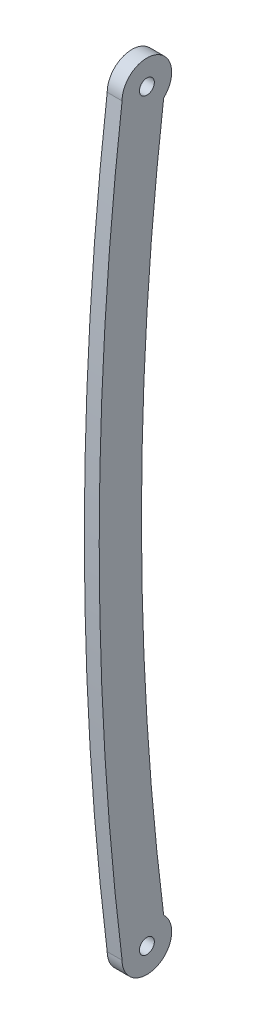
ISO-10303-21;
HEADER;
FILE_DESCRIPTION(('STEP AP214'),'2;1');
FILE_NAME('part.step','',(''),(''),'','','');
FILE_SCHEMA(('AUTOMOTIVE_DESIGN { 1 0 10303 214 1 1 1 1 }'));
ENDSEC;
DATA;
#1=APPLICATION_CONTEXT('core data for automotive mechanical design processes');
#2=APPLICATION_PROTOCOL_DEFINITION('international standard','automotive_design',2000,#1);
#3=PRODUCT_CONTEXT('',#1,'mechanical');
#4=PRODUCT('Part','Part','',(#3));
#5=PRODUCT_RELATED_PRODUCT_CATEGORY('part','',(#4));
#6=PRODUCT_DEFINITION_FORMATION('','',#4);
#7=PRODUCT_DEFINITION_CONTEXT('part definition',#1,'design');
#8=PRODUCT_DEFINITION('design','',#6,#7);
#9=PRODUCT_DEFINITION_SHAPE('','',#8);
#10=(LENGTH_UNIT() NAMED_UNIT(*) SI_UNIT(.MILLI.,.METRE.));
#11=(NAMED_UNIT(*) PLANE_ANGLE_UNIT() SI_UNIT($,.RADIAN.));
#12=(NAMED_UNIT(*) SI_UNIT($,.STERADIAN.) SOLID_ANGLE_UNIT());
#13=UNCERTAINTY_MEASURE_WITH_UNIT(LENGTH_MEASURE(1.E-05),#10,'distance_accuracy_value','');
#14=(GEOMETRIC_REPRESENTATION_CONTEXT(3) GLOBAL_UNCERTAINTY_ASSIGNED_CONTEXT((#13)) GLOBAL_UNIT_ASSIGNED_CONTEXT((#10,
#11,#12)) REPRESENTATION_CONTEXT('',''));
#15=CARTESIAN_POINT('',(0.,0.,0.));
#16=DIRECTION('',(0.,0.,1.));
#17=DIRECTION('',(1.,0.,0.));
#18=AXIS2_PLACEMENT_3D('',#15,#16,#17);
#19=CARTESIAN_POINT('',(3.,112.5,-301.557694252064));
#20=DIRECTION('',(-1.,0.,0.));
#21=DIRECTION('',(0.,0.,1.));
#22=AXIS2_PLACEMENT_3D('',#19,#20,#21);
#23=PLANE('',#22);
#24=CARTESIAN_POINT('',(3.,150.,0.));
#25=DIRECTION('',(1.,0.,0.));
#26=DIRECTION('',(0.,0.,-1.));
#27=AXIS2_PLACEMENT_3D('',#24,#25,#26);
#28=CIRCLE('',#27,1.5);
#29=CARTESIAN_POINT('',(3.,150.,-1.5));
#30=VERTEX_POINT('',#29);
#31=EDGE_CURVE('E99',#30,#30,#28,.T.);
#32=ORIENTED_EDGE('',*,*,#31,.F.);
#33=EDGE_LOOP('',(#32));
#34=FACE_BOUND('',#33,.T.);
#35=CARTESIAN_POINT('',(3.,75.,-603.115388504129));
#36=DIRECTION('',(1.,0.,0.));
#37=DIRECTION('',(0.,0.,1.));
#38=AXIS2_PLACEMENT_3D('',#35,#36,#37);
#39=CIRCLE('',#38,612.72287841693);
#40=CARTESIAN_POINT('',(3.,150.,5.));
#41=VERTEX_POINT('',#40);
#42=CARTESIAN_POINT('',(3.,0.,5.));
#43=VERTEX_POINT('',#42);
#44=EDGE_CURVE('E84',#41,#43,#39,.T.);
#45=ORIENTED_EDGE('',*,*,#44,.T.);
#46=CARTESIAN_POINT('',(3.,0.,0.));
#47=DIRECTION('',(1.,0.,0.));
#48=DIRECTION('',(0.,0.,-1.));
#49=AXIS2_PLACEMENT_3D('',#46,#47,#48);
#50=CIRCLE('',#49,5.);
#51=CARTESIAN_POINT('',(3.,3.6831384225469,-3.38149247527756));
#52=VERTEX_POINT('',#51);
#53=EDGE_CURVE('E79',#43,#52,#50,.T.);
#54=ORIENTED_EDGE('',*,*,#53,.T.);
#55=CARTESIAN_POINT('',(3.,75.,-569.080120257828));
#56=DIRECTION('',(-1.,0.,0.));
#57=DIRECTION('',(0.,0.,-1.));
#58=AXIS2_PLACEMENT_3D('',#55,#56,#57);
#59=CIRCLE('',#58,570.176316783079);
#60=CARTESIAN_POINT('',(3.,146.316861577453,-3.38149247527741));
#61=VERTEX_POINT('',#60);
#62=EDGE_CURVE('E82',#52,#61,#59,.T.);
#63=ORIENTED_EDGE('',*,*,#62,.T.);
#64=CARTESIAN_POINT('',(3.,150.,0.));
#65=DIRECTION('',(1.,0.,0.));
#66=DIRECTION('',(0.,0.,-1.));
#67=AXIS2_PLACEMENT_3D('',#64,#65,#66);
#68=CIRCLE('',#67,5.);
#69=EDGE_CURVE('E49',#61,#41,#68,.T.);
#70=ORIENTED_EDGE('',*,*,#69,.T.);
#71=EDGE_LOOP('',(#45,#54,#63,#70));
#72=FACE_BOUND('',#71,.T.);
#73=CARTESIAN_POINT('',(3.,0.,0.));
#74=DIRECTION('',(1.,0.,0.));
#75=DIRECTION('',(0.,0.,-1.));
#76=AXIS2_PLACEMENT_3D('',#73,#74,#75);
#77=CIRCLE('',#76,1.5);
#78=CARTESIAN_POINT('',(3.,0.,-1.5));
#79=VERTEX_POINT('',#78);
#80=EDGE_CURVE('E114',#79,#79,#77,.T.);
#81=ORIENTED_EDGE('',*,*,#80,.F.);
#82=EDGE_LOOP('',(#81));
#83=FACE_BOUND('',#82,.T.);
#84=ADVANCED_FACE('F32',(#34,#72,#83),#23,.F.);
#85=CARTESIAN_POINT('',(0.,112.5,-301.557694252064));
#86=DIRECTION('',(-1.,0.,0.));
#87=DIRECTION('',(0.,0.,1.));
#88=AXIS2_PLACEMENT_3D('',#85,#86,#87);
#89=PLANE('',#88);
#90=CARTESIAN_POINT('',(0.,150.,0.));
#91=DIRECTION('',(1.,0.,0.));
#92=DIRECTION('',(0.,0.,-1.));
#93=AXIS2_PLACEMENT_3D('',#90,#91,#92);
#94=CIRCLE('',#93,1.5);
#95=CARTESIAN_POINT('',(0.,150.,-1.5));
#96=VERTEX_POINT('',#95);
#97=EDGE_CURVE('E111',#96,#96,#94,.T.);
#98=ORIENTED_EDGE('',*,*,#97,.T.);
#99=EDGE_LOOP('',(#98));
#100=FACE_BOUND('',#99,.T.);
#101=CARTESIAN_POINT('',(0.,75.,-603.115388504129));
#102=DIRECTION('',(1.,0.,0.));
#103=DIRECTION('',(0.,0.,1.));
#104=AXIS2_PLACEMENT_3D('',#101,#102,#103);
#105=CIRCLE('',#104,612.72287841693);
#106=CARTESIAN_POINT('',(0.,150.,5.));
#107=VERTEX_POINT('',#106);
#108=CARTESIAN_POINT('',(0.,0.,5.));
#109=VERTEX_POINT('',#108);
#110=EDGE_CURVE('E96',#107,#109,#105,.T.);
#111=ORIENTED_EDGE('',*,*,#110,.F.);
#112=CARTESIAN_POINT('',(0.,150.,0.));
#113=DIRECTION('',(1.,0.,0.));
#114=DIRECTION('',(0.,0.,-1.));
#115=AXIS2_PLACEMENT_3D('',#112,#113,#114);
#116=CIRCLE('',#115,5.);
#117=CARTESIAN_POINT('',(0.,146.316861577453,-3.38149247527741));
#118=VERTEX_POINT('',#117);
#119=EDGE_CURVE('E72',#118,#107,#116,.T.);
#120=ORIENTED_EDGE('',*,*,#119,.F.);
#121=CARTESIAN_POINT('',(0.,75.,-569.080120257828));
#122=DIRECTION('',(-1.,0.,0.));
#123=DIRECTION('',(0.,0.,-1.));
#124=AXIS2_PLACEMENT_3D('',#121,#122,#123);
#125=CIRCLE('',#124,570.176316783079);
#126=CARTESIAN_POINT('',(0.,3.6831384225469,-3.38149247527756));
#127=VERTEX_POINT('',#126);
#128=EDGE_CURVE('E66',#127,#118,#125,.T.);
#129=ORIENTED_EDGE('',*,*,#128,.F.);
#130=CARTESIAN_POINT('',(0.,0.,0.));
#131=DIRECTION('',(1.,0.,0.));
#132=DIRECTION('',(0.,0.,-1.));
#133=AXIS2_PLACEMENT_3D('',#130,#131,#132);
#134=CIRCLE('',#133,5.);
#135=EDGE_CURVE('E88',#109,#127,#134,.T.);
#136=ORIENTED_EDGE('',*,*,#135,.F.);
#137=EDGE_LOOP('',(#111,#120,#129,#136));
#138=FACE_BOUND('',#137,.T.);
#139=CARTESIAN_POINT('',(0.,0.,0.));
#140=DIRECTION('',(1.,0.,0.));
#141=DIRECTION('',(0.,0.,-1.));
#142=AXIS2_PLACEMENT_3D('',#139,#140,#141);
#143=CIRCLE('',#142,1.5);
#144=CARTESIAN_POINT('',(0.,0.,-1.5));
#145=VERTEX_POINT('',#144);
#146=EDGE_CURVE('E117',#145,#145,#143,.T.);
#147=ORIENTED_EDGE('',*,*,#146,.T.);
#148=EDGE_LOOP('',(#147));
#149=FACE_BOUND('',#148,.T.);
#150=ADVANCED_FACE('F107',(#100,#138,#149),#89,.T.);
#151=CARTESIAN_POINT('',(3.,75.,-603.115388504129));
#152=DIRECTION('',(-1.,0.,0.));
#153=DIRECTION('',(0.,0.,1.));
#154=AXIS2_PLACEMENT_3D('',#151,#152,#153);
#155=CYLINDRICAL_SURFACE('',#154,612.72287841693);
#156=ORIENTED_EDGE('',*,*,#110,.T.);
#157=DIRECTION('',(-1.,0.,0.));
#158=VECTOR('',#157,1.);
#159=CARTESIAN_POINT('',(3.,0.,5.));
#160=LINE('',#159,#158);
#161=EDGE_CURVE('E11',#43,#109,#160,.T.);
#162=ORIENTED_EDGE('',*,*,#161,.F.);
#163=ORIENTED_EDGE('',*,*,#44,.F.);
#164=DIRECTION('',(-1.,0.,0.));
#165=VECTOR('',#164,1.);
#166=CARTESIAN_POINT('',(3.,150.,5.));
#167=LINE('',#166,#165);
#168=EDGE_CURVE('E92',#41,#107,#167,.T.);
#169=ORIENTED_EDGE('',*,*,#168,.T.);
#170=EDGE_LOOP('',(#156,#162,#163,#169));
#171=FACE_BOUND('',#170,.T.);
#172=ADVANCED_FACE('F34',(#171),#155,.T.);
#173=CARTESIAN_POINT('',(3.,0.,0.));
#174=DIRECTION('',(-1.,0.,0.));
#175=DIRECTION('',(0.,0.,1.));
#176=AXIS2_PLACEMENT_3D('',#173,#174,#175);
#177=CYLINDRICAL_SURFACE('',#176,5.);
#178=ORIENTED_EDGE('',*,*,#135,.T.);
#179=DIRECTION('',(-1.,0.,0.));
#180=VECTOR('',#179,1.);
#181=CARTESIAN_POINT('',(3.,3.6831384225469,-3.38149247527756));
#182=LINE('',#181,#180);
#183=EDGE_CURVE('E41',#52,#127,#182,.T.);
#184=ORIENTED_EDGE('',*,*,#183,.F.);
#185=ORIENTED_EDGE('',*,*,#53,.F.);
#186=ORIENTED_EDGE('',*,*,#161,.T.);
#187=EDGE_LOOP('',(#178,#184,#185,#186));
#188=FACE_BOUND('',#187,.T.);
#189=ADVANCED_FACE('F87',(#188),#177,.T.);
#190=CARTESIAN_POINT('',(3.,75.,-569.080120257828));
#191=DIRECTION('',(-1.,0.,0.));
#192=DIRECTION('',(0.,0.,1.));
#193=AXIS2_PLACEMENT_3D('',#190,#191,#192);
#194=CYLINDRICAL_SURFACE('',#193,570.176316783079);
#195=ORIENTED_EDGE('',*,*,#128,.T.);
#196=DIRECTION('',(-1.,0.,0.));
#197=VECTOR('',#196,1.);
#198=CARTESIAN_POINT('',(3.,146.316861577453,-3.38149247527741));
#199=LINE('',#198,#197);
#200=EDGE_CURVE('E89',#61,#118,#199,.T.);
#201=ORIENTED_EDGE('',*,*,#200,.F.);
#202=ORIENTED_EDGE('',*,*,#62,.F.);
#203=ORIENTED_EDGE('',*,*,#183,.T.);
#204=EDGE_LOOP('',(#195,#201,#202,#203));
#205=FACE_BOUND('',#204,.T.);
#206=ADVANCED_FACE('F90',(#205),#194,.F.);
#207=CARTESIAN_POINT('',(3.,150.,0.));
#208=DIRECTION('',(-1.,0.,0.));
#209=DIRECTION('',(0.,0.,1.));
#210=AXIS2_PLACEMENT_3D('',#207,#208,#209);
#211=CYLINDRICAL_SURFACE('',#210,5.);
#212=ORIENTED_EDGE('',*,*,#119,.T.);
#213=ORIENTED_EDGE('',*,*,#168,.F.);
#214=ORIENTED_EDGE('',*,*,#69,.F.);
#215=ORIENTED_EDGE('',*,*,#200,.T.);
#216=EDGE_LOOP('',(#212,#213,#214,#215));
#217=FACE_BOUND('',#216,.T.);
#218=ADVANCED_FACE('F104',(#217),#211,.T.);
#219=CARTESIAN_POINT('',(3.,150.,0.));
#220=DIRECTION('',(-1.,0.,0.));
#221=DIRECTION('',(0.,0.,1.));
#222=AXIS2_PLACEMENT_3D('',#219,#220,#221);
#223=CYLINDRICAL_SURFACE('',#222,1.5);
#224=ORIENTED_EDGE('',*,*,#31,.T.);
#225=EDGE_LOOP('',(#224));
#226=FACE_BOUND('',#225,.T.);
#227=ORIENTED_EDGE('',*,*,#97,.F.);
#228=EDGE_LOOP('',(#227));
#229=FACE_BOUND('',#228,.T.);
#230=ADVANCED_FACE('F135',(#226,#229),#223,.F.);
#231=CARTESIAN_POINT('',(3.,0.,0.));
#232=DIRECTION('',(-1.,0.,0.));
#233=DIRECTION('',(0.,0.,1.));
#234=AXIS2_PLACEMENT_3D('',#231,#232,#233);
#235=CYLINDRICAL_SURFACE('',#234,1.5);
#236=ORIENTED_EDGE('',*,*,#80,.T.);
#237=EDGE_LOOP('',(#236));
#238=FACE_BOUND('',#237,.T.);
#239=ORIENTED_EDGE('',*,*,#146,.F.);
#240=EDGE_LOOP('',(#239));
#241=FACE_BOUND('',#240,.T.);
#242=ADVANCED_FACE('F123',(#238,#241),#235,.F.);
#243=CLOSED_SHELL('',(#84,#150,#172,#189,#206,#218,#230,#242));
#244=MANIFOLD_SOLID_BREP('B2',#243);
#245=ADVANCED_BREP_SHAPE_REPRESENTATION('',(#18,#244),#14);
#246=SHAPE_DEFINITION_REPRESENTATION(#9,#245);
ENDSEC;
END-ISO-10303-21;
